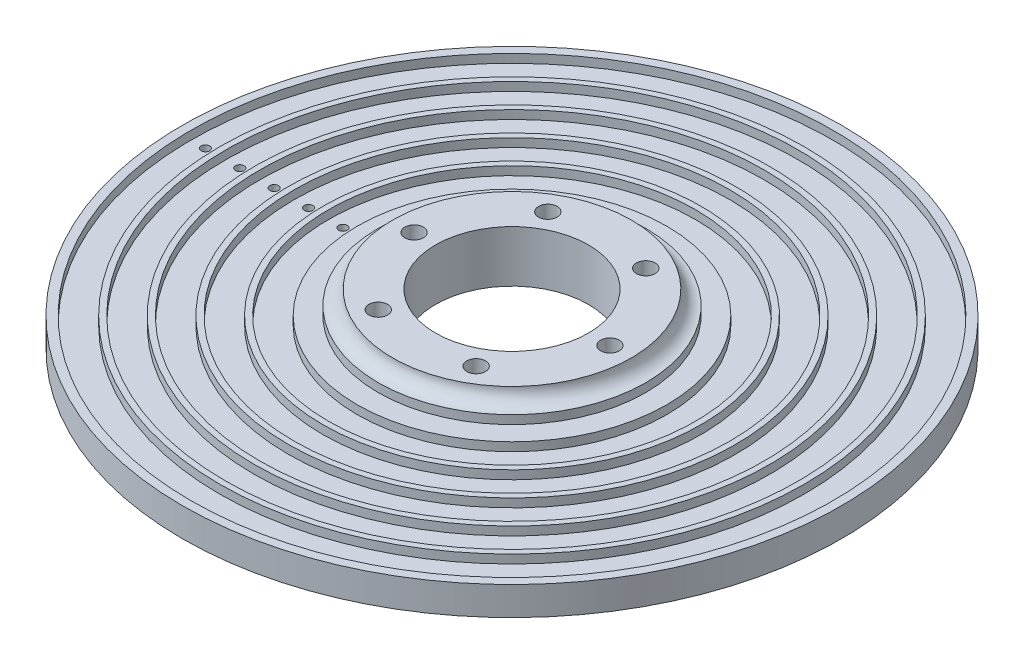
ISO-10303-21;
HEADER;
FILE_DESCRIPTION(('STEP AP214'),'2;1');
FILE_NAME('part.step','',(''),(''),'','','');
FILE_SCHEMA(('AUTOMOTIVE_DESIGN { 1 0 10303 214 1 1 1 1 }'));
ENDSEC;
DATA;
#1=APPLICATION_CONTEXT('core data for automotive mechanical design processes');
#2=APPLICATION_PROTOCOL_DEFINITION('international standard','automotive_design',2000,#1);
#3=PRODUCT_CONTEXT('',#1,'mechanical');
#4=PRODUCT('Part','Part','',(#3));
#5=PRODUCT_RELATED_PRODUCT_CATEGORY('part','',(#4));
#6=PRODUCT_DEFINITION_FORMATION('','',#4);
#7=PRODUCT_DEFINITION_CONTEXT('part definition',#1,'design');
#8=PRODUCT_DEFINITION('design','',#6,#7);
#9=PRODUCT_DEFINITION_SHAPE('','',#8);
#10=(LENGTH_UNIT() NAMED_UNIT(*) SI_UNIT(.MILLI.,.METRE.));
#11=(NAMED_UNIT(*) PLANE_ANGLE_UNIT() SI_UNIT($,.RADIAN.));
#12=(NAMED_UNIT(*) SI_UNIT($,.STERADIAN.) SOLID_ANGLE_UNIT());
#13=UNCERTAINTY_MEASURE_WITH_UNIT(LENGTH_MEASURE(1.E-05),#10,'distance_accuracy_value','');
#14=(GEOMETRIC_REPRESENTATION_CONTEXT(3) GLOBAL_UNCERTAINTY_ASSIGNED_CONTEXT((#13)) GLOBAL_UNIT_ASSIGNED_CONTEXT((#10,
#11,#12)) REPRESENTATION_CONTEXT('',''));
#15=CARTESIAN_POINT('',(0.,0.,0.));
#16=DIRECTION('',(0.,0.,1.));
#17=DIRECTION('',(1.,0.,0.));
#18=AXIS2_PLACEMENT_3D('',#15,#16,#17);
#19=CARTESIAN_POINT('',(8.54250000000001,-5.,14.7960440236571));
#20=DIRECTION('',(0.,1.,0.));
#21=DIRECTION('',(0.,0.,1.));
#22=AXIS2_PLACEMENT_3D('',#19,#20,#21);
#23=CYLINDRICAL_SURFACE('',#22,1.625);
#24=CARTESIAN_POINT('',(8.54250000000001,4.,14.7960440236571));
#25=DIRECTION('',(0.,1.,0.));
#26=DIRECTION('',(0.,0.,1.));
#27=AXIS2_PLACEMENT_3D('',#24,#25,#26);
#28=CIRCLE('',#27,1.625);
#29=CARTESIAN_POINT('',(8.54250000000001,4.,16.4210440236571));
#30=VERTEX_POINT('',#29);
#31=EDGE_CURVE('E174',#30,#30,#28,.T.);
#32=ORIENTED_EDGE('',*,*,#31,.T.);
#33=EDGE_LOOP('',(#32));
#34=FACE_BOUND('',#33,.T.);
#35=CARTESIAN_POINT('',(8.54250000000001,-2.,14.7960440236571));
#36=DIRECTION('',(0.,-1.,0.));
#37=DIRECTION('',(0.,0.,-1.));
#38=AXIS2_PLACEMENT_3D('',#35,#36,#37);
#39=CIRCLE('',#38,1.625);
#40=CARTESIAN_POINT('',(8.54250000000001,-2.,13.1710440236571));
#41=VERTEX_POINT('',#40);
#42=EDGE_CURVE('E95',#41,#41,#39,.F.);
#43=ORIENTED_EDGE('',*,*,#42,.F.);
#44=EDGE_LOOP('',(#43));
#45=FACE_BOUND('',#44,.T.);
#46=ADVANCED_FACE('F91',(#34,#45),#23,.F.);
#47=CARTESIAN_POINT('',(8.5425,-5.,-14.7960440236571));
#48=DIRECTION('',(0.,1.,0.));
#49=DIRECTION('',(0.,0.,1.));
#50=AXIS2_PLACEMENT_3D('',#47,#48,#49);
#51=CYLINDRICAL_SURFACE('',#50,1.625);
#52=CARTESIAN_POINT('',(8.5425,4.,-14.7960440236571));
#53=DIRECTION('',(0.,1.,0.));
#54=DIRECTION('',(0.,0.,1.));
#55=AXIS2_PLACEMENT_3D('',#52,#53,#54);
#56=CIRCLE('',#55,1.625);
#57=CARTESIAN_POINT('',(8.5425,4.,-13.1710440236571));
#58=VERTEX_POINT('',#57);
#59=EDGE_CURVE('E165',#58,#58,#56,.T.);
#60=ORIENTED_EDGE('',*,*,#59,.T.);
#61=EDGE_LOOP('',(#60));
#62=FACE_BOUND('',#61,.T.);
#63=CARTESIAN_POINT('',(8.5425,-2.,-14.7960440236571));
#64=DIRECTION('',(0.,-1.,0.));
#65=DIRECTION('',(0.,0.,-1.));
#66=AXIS2_PLACEMENT_3D('',#63,#64,#65);
#67=CIRCLE('',#66,1.625);
#68=CARTESIAN_POINT('',(8.5425,-2.,-16.4210440236571));
#69=VERTEX_POINT('',#68);
#70=EDGE_CURVE('E117',#69,#69,#67,.F.);
#71=ORIENTED_EDGE('',*,*,#70,.F.);
#72=EDGE_LOOP('',(#71));
#73=FACE_BOUND('',#72,.T.);
#74=ADVANCED_FACE('F291',(#62,#73),#51,.F.);
#75=CARTESIAN_POINT('',(-17.085,-5.,0.));
#76=DIRECTION('',(0.,1.,0.));
#77=DIRECTION('',(0.,0.,1.));
#78=AXIS2_PLACEMENT_3D('',#75,#76,#77);
#79=CYLINDRICAL_SURFACE('',#78,1.625);
#80=CARTESIAN_POINT('',(-17.085,4.,0.));
#81=DIRECTION('',(0.,1.,0.));
#82=DIRECTION('',(0.,0.,1.));
#83=AXIS2_PLACEMENT_3D('',#80,#81,#82);
#84=CIRCLE('',#83,1.625);
#85=CARTESIAN_POINT('',(-17.085,4.,1.62500000000001));
#86=VERTEX_POINT('',#85);
#87=EDGE_CURVE('E183',#86,#86,#84,.T.);
#88=ORIENTED_EDGE('',*,*,#87,.T.);
#89=EDGE_LOOP('',(#88));
#90=FACE_BOUND('',#89,.T.);
#91=CARTESIAN_POINT('',(-17.085,-2.,0.));
#92=DIRECTION('',(0.,-1.,0.));
#93=DIRECTION('',(0.,0.,-1.));
#94=AXIS2_PLACEMENT_3D('',#91,#92,#93);
#95=CIRCLE('',#94,1.625);
#96=CARTESIAN_POINT('',(-17.085,-2.,-1.625));
#97=VERTEX_POINT('',#96);
#98=EDGE_CURVE('E113',#97,#97,#95,.F.);
#99=ORIENTED_EDGE('',*,*,#98,.F.);
#100=EDGE_LOOP('',(#99));
#101=FACE_BOUND('',#100,.T.);
#102=ADVANCED_FACE('F298',(#90,#101),#79,.F.);
#103=CARTESIAN_POINT('',(0.,4.,0.));
#104=DIRECTION('',(0.,1.,0.));
#105=DIRECTION('',(0.,0.,1.));
#106=AXIS2_PLACEMENT_3D('',#103,#104,#105);
#107=PLANE('',#106);
#108=ORIENTED_EDGE('',*,*,#59,.F.);
#109=EDGE_LOOP('',(#108));
#110=FACE_BOUND('',#109,.T.);
#111=CARTESIAN_POINT('',(17.085,4.,0.));
#112=DIRECTION('',(0.,1.,0.));
#113=DIRECTION('',(0.,0.,1.));
#114=AXIS2_PLACEMENT_3D('',#111,#112,#113);
#115=CIRCLE('',#114,1.625);
#116=CARTESIAN_POINT('',(17.085,4.,1.62499999999999));
#117=VERTEX_POINT('',#116);
#118=EDGE_CURVE('E170',#117,#117,#115,.T.);
#119=ORIENTED_EDGE('',*,*,#118,.F.);
#120=EDGE_LOOP('',(#119));
#121=FACE_BOUND('',#120,.T.);
#122=ORIENTED_EDGE('',*,*,#31,.F.);
#123=EDGE_LOOP('',(#122));
#124=FACE_BOUND('',#123,.T.);
#125=CARTESIAN_POINT('',(-8.5425,4.,14.7960440236571));
#126=DIRECTION('',(0.,1.,0.));
#127=DIRECTION('',(0.,0.,1.));
#128=AXIS2_PLACEMENT_3D('',#125,#126,#127);
#129=CIRCLE('',#128,1.625);
#130=CARTESIAN_POINT('',(-8.5425,4.,16.4210440236571));
#131=VERTEX_POINT('',#130);
#132=EDGE_CURVE('E179',#131,#131,#129,.T.);
#133=ORIENTED_EDGE('',*,*,#132,.F.);
#134=EDGE_LOOP('',(#133));
#135=FACE_BOUND('',#134,.T.);
#136=ORIENTED_EDGE('',*,*,#87,.F.);
#137=EDGE_LOOP('',(#136));
#138=FACE_BOUND('',#137,.T.);
#139=CARTESIAN_POINT('',(-8.54250000000001,4.,-14.7960440236571));
#140=DIRECTION('',(0.,1.,0.));
#141=DIRECTION('',(0.,0.,1.));
#142=AXIS2_PLACEMENT_3D('',#139,#140,#141);
#143=CIRCLE('',#142,1.625);
#144=CARTESIAN_POINT('',(-8.54250000000001,4.,-13.1710440236571));
#145=VERTEX_POINT('',#144);
#146=EDGE_CURVE('E188',#145,#145,#143,.T.);
#147=ORIENTED_EDGE('',*,*,#146,.F.);
#148=EDGE_LOOP('',(#147));
#149=FACE_BOUND('',#148,.T.);
#150=CARTESIAN_POINT('',(0.,4.,0.));
#151=DIRECTION('',(0.,1.,0.));
#152=DIRECTION('',(0.,0.,1.));
#153=AXIS2_PLACEMENT_3D('',#150,#151,#152);
#154=CIRCLE('',#153,13.335);
#155=CARTESIAN_POINT('',(0.,4.,13.335));
#156=VERTEX_POINT('',#155);
#157=EDGE_CURVE('E11',#156,#156,#154,.T.);
#158=ORIENTED_EDGE('',*,*,#157,.F.);
#159=EDGE_LOOP('',(#158));
#160=FACE_BOUND('',#159,.T.);
#161=CARTESIAN_POINT('',(0.,4.,0.));
#162=DIRECTION('',(0.,-1.,0.));
#163=DIRECTION('',(0.,0.,-1.));
#164=AXIS2_PLACEMENT_3D('',#161,#162,#163);
#165=CIRCLE('',#164,20.835);
#166=CARTESIAN_POINT('',(0.,4.,-20.835));
#167=VERTEX_POINT('',#166);
#168=EDGE_CURVE('E111',#167,#167,#165,.T.);
#169=ORIENTED_EDGE('',*,*,#168,.F.);
#170=EDGE_LOOP('',(#169));
#171=FACE_BOUND('',#170,.T.);
#172=ADVANCED_FACE('F285',(#110,#121,#124,#135,#138,#149,#160,#171),#107,.T.);
#173=CARTESIAN_POINT('',(0.,0.,0.));
#174=DIRECTION('',(0.,-1.,0.));
#175=DIRECTION('',(0.,0.,-1.));
#176=AXIS2_PLACEMENT_3D('',#173,#174,#175);
#177=PLANE('',#176);
#178=CARTESIAN_POINT('',(0.,0.,0.));
#179=DIRECTION('',(0.,1.,0.));
#180=DIRECTION('',(0.,0.,1.));
#181=AXIS2_PLACEMENT_3D('',#178,#179,#180);
#182=CIRCLE('',#181,50.);
#183=CARTESIAN_POINT('',(0.,0.,50.));
#184=VERTEX_POINT('',#183);
#185=EDGE_CURVE('E212',#184,#184,#182,.T.);
#186=ORIENTED_EDGE('',*,*,#185,.F.);
#187=EDGE_LOOP('',(#186));
#188=FACE_BOUND('',#187,.T.);
#189=CARTESIAN_POINT('',(0.,0.,0.));
#190=DIRECTION('',(0.,1.,0.));
#191=DIRECTION('',(0.,0.,1.));
#192=AXIS2_PLACEMENT_3D('',#189,#190,#191);
#193=CIRCLE('',#192,51.);
#194=CARTESIAN_POINT('',(0.,0.,51.));
#195=VERTEX_POINT('',#194);
#196=EDGE_CURVE('E195',#195,#195,#193,.T.);
#197=ORIENTED_EDGE('',*,*,#196,.T.);
#198=EDGE_LOOP('',(#197));
#199=FACE_BOUND('',#198,.T.);
#200=ADVANCED_FACE('F271',(#188,#199),#177,.F.);
#201=CARTESIAN_POINT('',(0.,0.,0.));
#202=DIRECTION('',(0.,1.,0.));
#203=DIRECTION('',(0.,0.,1.));
#204=AXIS2_PLACEMENT_3D('',#201,#202,#203);
#205=CIRCLE('',#204,44.);
#206=CARTESIAN_POINT('',(0.,0.,44.));
#207=VERTEX_POINT('',#206);
#208=EDGE_CURVE('E224',#207,#207,#205,.T.);
#209=ORIENTED_EDGE('',*,*,#208,.F.);
#210=EDGE_LOOP('',(#209));
#211=FACE_BOUND('',#210,.T.);
#212=CARTESIAN_POINT('',(0.,0.,0.));
#213=DIRECTION('',(0.,1.,0.));
#214=DIRECTION('',(0.,0.,1.));
#215=AXIS2_PLACEMENT_3D('',#212,#213,#214);
#216=CIRCLE('',#215,45.);
#217=CARTESIAN_POINT('',(0.,0.,45.));
#218=VERTEX_POINT('',#217);
#219=EDGE_CURVE('E203',#218,#218,#216,.T.);
#220=ORIENTED_EDGE('',*,*,#219,.T.);
#221=EDGE_LOOP('',(#220));
#222=FACE_BOUND('',#221,.T.);
#223=ADVANCED_FACE('F284',(#211,#222),#177,.F.);
#224=CARTESIAN_POINT('',(0.,0.,0.));
#225=DIRECTION('',(0.,1.,0.));
#226=DIRECTION('',(0.,0.,1.));
#227=AXIS2_PLACEMENT_3D('',#224,#225,#226);
#228=CIRCLE('',#227,38.);
#229=CARTESIAN_POINT('',(0.,0.,38.));
#230=VERTEX_POINT('',#229);
#231=EDGE_CURVE('E236',#230,#230,#228,.T.);
#232=ORIENTED_EDGE('',*,*,#231,.F.);
#233=EDGE_LOOP('',(#232));
#234=FACE_BOUND('',#233,.T.);
#235=CARTESIAN_POINT('',(0.,0.,0.));
#236=DIRECTION('',(0.,1.,0.));
#237=DIRECTION('',(0.,0.,1.));
#238=AXIS2_PLACEMENT_3D('',#235,#236,#237);
#239=CIRCLE('',#238,39.);
#240=CARTESIAN_POINT('',(0.,0.,39.));
#241=VERTEX_POINT('',#240);
#242=EDGE_CURVE('E215',#241,#241,#239,.T.);
#243=ORIENTED_EDGE('',*,*,#242,.T.);
#244=EDGE_LOOP('',(#243));
#245=FACE_BOUND('',#244,.T.);
#246=ADVANCED_FACE('F395',(#234,#245),#177,.F.);
#247=CARTESIAN_POINT('',(0.,0.,0.));
#248=DIRECTION('',(0.,1.,0.));
#249=DIRECTION('',(0.,0.,1.));
#250=AXIS2_PLACEMENT_3D('',#247,#248,#249);
#251=CIRCLE('',#250,32.);
#252=CARTESIAN_POINT('',(0.,0.,32.));
#253=VERTEX_POINT('',#252);
#254=EDGE_CURVE('E248',#253,#253,#251,.T.);
#255=ORIENTED_EDGE('',*,*,#254,.F.);
#256=EDGE_LOOP('',(#255));
#257=FACE_BOUND('',#256,.T.);
#258=CARTESIAN_POINT('',(0.,0.,0.));
#259=DIRECTION('',(0.,1.,0.));
#260=DIRECTION('',(0.,0.,1.));
#261=AXIS2_PLACEMENT_3D('',#258,#259,#260);
#262=CIRCLE('',#261,33.);
#263=CARTESIAN_POINT('',(0.,0.,33.));
#264=VERTEX_POINT('',#263);
#265=EDGE_CURVE('E227',#264,#264,#262,.T.);
#266=ORIENTED_EDGE('',*,*,#265,.T.);
#267=EDGE_LOOP('',(#266));
#268=FACE_BOUND('',#267,.T.);
#269=ADVANCED_FACE('F288',(#257,#268),#177,.F.);
#270=CARTESIAN_POINT('',(0.,0.,0.));
#271=DIRECTION('',(0.,-1.,0.));
#272=DIRECTION('',(0.,0.,-1.));
#273=AXIS2_PLACEMENT_3D('',#270,#271,#272);
#274=CIRCLE('',#273,23.335);
#275=CARTESIAN_POINT('',(0.,0.,-23.335));
#276=VERTEX_POINT('',#275);
#277=EDGE_CURVE('E99',#276,#276,#274,.T.);
#278=ORIENTED_EDGE('',*,*,#277,.T.);
#279=EDGE_LOOP('',(#278));
#280=FACE_BOUND('',#279,.T.);
#281=CARTESIAN_POINT('',(0.,0.,0.));
#282=DIRECTION('',(0.,1.,0.));
#283=DIRECTION('',(0.,0.,1.));
#284=AXIS2_PLACEMENT_3D('',#281,#282,#283);
#285=CIRCLE('',#284,27.);
#286=CARTESIAN_POINT('',(0.,0.,27.));
#287=VERTEX_POINT('',#286);
#288=EDGE_CURVE('E239',#287,#287,#285,.T.);
#289=ORIENTED_EDGE('',*,*,#288,.T.);
#290=EDGE_LOOP('',(#289));
#291=FACE_BOUND('',#290,.T.);
#292=ADVANCED_FACE('F272',(#280,#291),#177,.F.);
#293=CARTESIAN_POINT('',(0.,4.,0.));
#294=DIRECTION('',(0.,-1.,0.));
#295=DIRECTION('',(0.,0.,-1.));
#296=AXIS2_PLACEMENT_3D('',#293,#294,#295);
#297=CYLINDRICAL_SURFACE('',#296,23.335);
#298=CARTESIAN_POINT('',(0.,1.5,0.));
#299=DIRECTION('',(0.,1.,0.));
#300=DIRECTION('',(0.,0.,1.));
#301=AXIS2_PLACEMENT_3D('',#298,#299,#300);
#302=CIRCLE('',#301,23.335);
#303=CARTESIAN_POINT('',(0.,1.5,23.335));
#304=VERTEX_POINT('',#303);
#305=EDGE_CURVE('E108',#304,#304,#302,.F.);
#306=ORIENTED_EDGE('',*,*,#305,.T.);
#307=EDGE_LOOP('',(#306));
#308=FACE_BOUND('',#307,.T.);
#309=ORIENTED_EDGE('',*,*,#277,.F.);
#310=EDGE_LOOP('',(#309));
#311=FACE_BOUND('',#310,.T.);
#312=ADVANCED_FACE('F93',(#308,#311),#297,.T.);
#313=CARTESIAN_POINT('',(0.,4.,0.));
#314=DIRECTION('',(0.,-1.,0.));
#315=DIRECTION('',(0.,0.,-1.));
#316=AXIS2_PLACEMENT_3D('',#313,#314,#315);
#317=CYLINDRICAL_SURFACE('',#316,13.335);
#318=ORIENTED_EDGE('',*,*,#157,.T.);
#319=EDGE_LOOP('',(#318));
#320=FACE_BOUND('',#319,.T.);
#321=CARTESIAN_POINT('',(0.,-5.,0.));
#322=DIRECTION('',(0.,-1.,0.));
#323=DIRECTION('',(0.,0.,-1.));
#324=AXIS2_PLACEMENT_3D('',#321,#322,#323);
#325=CIRCLE('',#324,13.335);
#326=CARTESIAN_POINT('',(0.,-5.,-13.335));
#327=VERTEX_POINT('',#326);
#328=EDGE_CURVE('E251',#327,#327,#325,.T.);
#329=ORIENTED_EDGE('',*,*,#328,.T.);
#330=EDGE_LOOP('',(#329));
#331=FACE_BOUND('',#330,.T.);
#332=ADVANCED_FACE('F268',(#320,#331),#317,.F.);
#333=CARTESIAN_POINT('',(0.,0.,0.));
#334=DIRECTION('',(0.,1.,0.));
#335=DIRECTION('',(0.,0.,1.));
#336=AXIS2_PLACEMENT_3D('',#333,#334,#335);
#337=CIRCLE('',#336,56.);
#338=CARTESIAN_POINT('',(0.,0.,56.));
#339=VERTEX_POINT('',#338);
#340=EDGE_CURVE('E200',#339,#339,#337,.T.);
#341=ORIENTED_EDGE('',*,*,#340,.F.);
#342=EDGE_LOOP('',(#341));
#343=FACE_BOUND('',#342,.T.);
#344=CARTESIAN_POINT('',(0.,0.,0.));
#345=DIRECTION('',(0.,-1.,0.));
#346=DIRECTION('',(0.,0.,-1.));
#347=AXIS2_PLACEMENT_3D('',#344,#345,#346);
#348=CIRCLE('',#347,57.5);
#349=CARTESIAN_POINT('',(0.,0.,-57.5));
#350=VERTEX_POINT('',#349);
#351=EDGE_CURVE('E258',#350,#350,#348,.T.);
#352=ORIENTED_EDGE('',*,*,#351,.F.);
#353=EDGE_LOOP('',(#352));
#354=FACE_BOUND('',#353,.T.);
#355=ADVANCED_FACE('F265',(#343,#354),#177,.F.);
#356=CARTESIAN_POINT('',(0.,-5.,0.));
#357=DIRECTION('',(0.,-1.,0.));
#358=DIRECTION('',(0.,0.,-1.));
#359=AXIS2_PLACEMENT_3D('',#356,#357,#358);
#360=PLANE('',#359);
#361=CARTESIAN_POINT('',(8.54250000000001,-5.,14.7960440236571));
#362=DIRECTION('',(0.,-1.,0.));
#363=DIRECTION('',(0.,0.,-1.));
#364=AXIS2_PLACEMENT_3D('',#361,#362,#363);
#365=CIRCLE('',#364,3.);
#366=CARTESIAN_POINT('',(8.54250000000001,-5.,11.7960440236571));
#367=VERTEX_POINT('',#366);
#368=EDGE_CURVE('E133',#367,#367,#365,.T.);
#369=ORIENTED_EDGE('',*,*,#368,.F.);
#370=EDGE_LOOP('',(#369));
#371=FACE_BOUND('',#370,.T.);
#372=CARTESIAN_POINT('',(8.5425,-5.,-14.7960440236571));
#373=DIRECTION('',(0.,-1.,0.));
#374=DIRECTION('',(0.,0.,-1.));
#375=AXIS2_PLACEMENT_3D('',#372,#373,#374);
#376=CIRCLE('',#375,3.);
#377=CARTESIAN_POINT('',(8.5425,-5.,-17.7960440236571));
#378=VERTEX_POINT('',#377);
#379=EDGE_CURVE('E126',#378,#378,#376,.T.);
#380=ORIENTED_EDGE('',*,*,#379,.F.);
#381=EDGE_LOOP('',(#380));
#382=FACE_BOUND('',#381,.T.);
#383=CARTESIAN_POINT('',(-17.085,-5.,0.));
#384=DIRECTION('',(0.,-1.,0.));
#385=DIRECTION('',(0.,0.,-1.));
#386=AXIS2_PLACEMENT_3D('',#383,#384,#385);
#387=CIRCLE('',#386,3.);
#388=CARTESIAN_POINT('',(-17.085,-5.,-2.99999999999999));
#389=VERTEX_POINT('',#388);
#390=EDGE_CURVE('E119',#389,#389,#387,.T.);
#391=ORIENTED_EDGE('',*,*,#390,.F.);
#392=EDGE_LOOP('',(#391));
#393=FACE_BOUND('',#392,.T.);
#394=CARTESIAN_POINT('',(-29.5,-5.,0.));
#395=DIRECTION('',(0.,1.,0.));
#396=DIRECTION('',(0.,0.,1.));
#397=AXIS2_PLACEMENT_3D('',#394,#395,#396);
#398=CIRCLE('',#397,0.750000000000002);
#399=CARTESIAN_POINT('',(-29.5,-5.,0.750000000000002));
#400=VERTEX_POINT('',#399);
#401=EDGE_CURVE('E138',#400,#400,#398,.T.);
#402=ORIENTED_EDGE('',*,*,#401,.T.);
#403=EDGE_LOOP('',(#402));
#404=FACE_BOUND('',#403,.T.);
#405=CARTESIAN_POINT('',(-35.5,-5.,0.));
#406=DIRECTION('',(0.,1.,0.));
#407=DIRECTION('',(0.,0.,1.));
#408=AXIS2_PLACEMENT_3D('',#405,#406,#407);
#409=CIRCLE('',#408,0.749999999999999);
#410=CARTESIAN_POINT('',(-35.5,-5.,0.749999999999999));
#411=VERTEX_POINT('',#410);
#412=EDGE_CURVE('E144',#411,#411,#409,.T.);
#413=ORIENTED_EDGE('',*,*,#412,.T.);
#414=EDGE_LOOP('',(#413));
#415=FACE_BOUND('',#414,.T.);
#416=CARTESIAN_POINT('',(-41.5,-5.,0.));
#417=DIRECTION('',(0.,1.,0.));
#418=DIRECTION('',(0.,0.,1.));
#419=AXIS2_PLACEMENT_3D('',#416,#417,#418);
#420=CIRCLE('',#419,0.749999999999999);
#421=CARTESIAN_POINT('',(-41.5,-5.,0.749999999999999));
#422=VERTEX_POINT('',#421);
#423=EDGE_CURVE('E150',#422,#422,#420,.T.);
#424=ORIENTED_EDGE('',*,*,#423,.T.);
#425=EDGE_LOOP('',(#424));
#426=FACE_BOUND('',#425,.T.);
#427=CARTESIAN_POINT('',(-47.5,-5.,0.));
#428=DIRECTION('',(0.,1.,0.));
#429=DIRECTION('',(0.,0.,1.));
#430=AXIS2_PLACEMENT_3D('',#427,#428,#429);
#431=CIRCLE('',#430,0.749999999999999);
#432=CARTESIAN_POINT('',(-47.5,-5.,0.749999999999999));
#433=VERTEX_POINT('',#432);
#434=EDGE_CURVE('E156',#433,#433,#431,.T.);
#435=ORIENTED_EDGE('',*,*,#434,.T.);
#436=EDGE_LOOP('',(#435));
#437=FACE_BOUND('',#436,.T.);
#438=CARTESIAN_POINT('',(-53.5,-5.,0.));
#439=DIRECTION('',(0.,1.,0.));
#440=DIRECTION('',(0.,0.,1.));
#441=AXIS2_PLACEMENT_3D('',#438,#439,#440);
#442=CIRCLE('',#441,0.749999999999999);
#443=CARTESIAN_POINT('',(-53.5,-5.,0.749999999999999));
#444=VERTEX_POINT('',#443);
#445=EDGE_CURVE('E162',#444,#444,#442,.T.);
#446=ORIENTED_EDGE('',*,*,#445,.T.);
#447=EDGE_LOOP('',(#446));
#448=FACE_BOUND('',#447,.T.);
#449=CARTESIAN_POINT('',(17.085,-5.,0.));
#450=DIRECTION('',(0.,1.,0.));
#451=DIRECTION('',(0.,0.,1.));
#452=AXIS2_PLACEMENT_3D('',#449,#450,#451);
#453=CIRCLE('',#452,1.625);
#454=CARTESIAN_POINT('',(17.085,-5.,1.62499999999999));
#455=VERTEX_POINT('',#454);
#456=EDGE_CURVE('E171',#455,#455,#453,.T.);
#457=ORIENTED_EDGE('',*,*,#456,.T.);
#458=EDGE_LOOP('',(#457));
#459=FACE_BOUND('',#458,.T.);
#460=CARTESIAN_POINT('',(-8.5425,-5.,14.7960440236571));
#461=DIRECTION('',(0.,1.,0.));
#462=DIRECTION('',(0.,0.,1.));
#463=AXIS2_PLACEMENT_3D('',#460,#461,#462);
#464=CIRCLE('',#463,1.625);
#465=CARTESIAN_POINT('',(-8.5425,-5.,16.4210440236571));
#466=VERTEX_POINT('',#465);
#467=EDGE_CURVE('E180',#466,#466,#464,.T.);
#468=ORIENTED_EDGE('',*,*,#467,.T.);
#469=EDGE_LOOP('',(#468));
#470=FACE_BOUND('',#469,.T.);
#471=CARTESIAN_POINT('',(-8.54250000000001,-5.,-14.7960440236571));
#472=DIRECTION('',(0.,1.,0.));
#473=DIRECTION('',(0.,0.,1.));
#474=AXIS2_PLACEMENT_3D('',#471,#472,#473);
#475=CIRCLE('',#474,1.625);
#476=CARTESIAN_POINT('',(-8.54250000000001,-5.,-13.1710440236571));
#477=VERTEX_POINT('',#476);
#478=EDGE_CURVE('E112',#477,#477,#475,.T.);
#479=ORIENTED_EDGE('',*,*,#478,.T.);
#480=EDGE_LOOP('',(#479));
#481=FACE_BOUND('',#480,.T.);
#482=CARTESIAN_POINT('',(0.,-5.,0.));
#483=DIRECTION('',(0.,-1.,0.));
#484=DIRECTION('',(0.,0.,-1.));
#485=AXIS2_PLACEMENT_3D('',#482,#483,#484);
#486=CIRCLE('',#485,57.5);
#487=CARTESIAN_POINT('',(0.,-5.,-57.5));
#488=VERTEX_POINT('',#487);
#489=EDGE_CURVE('E104',#488,#488,#486,.T.);
#490=ORIENTED_EDGE('',*,*,#489,.T.);
#491=EDGE_LOOP('',(#490));
#492=FACE_BOUND('',#491,.T.);
#493=ORIENTED_EDGE('',*,*,#328,.F.);
#494=EDGE_LOOP('',(#493));
#495=FACE_BOUND('',#494,.T.);
#496=ADVANCED_FACE('F267',(#371,#382,#393,#404,#415,#426,#437,#448,#459,#470,#481,#492,#495),
#360,.T.);
#497=CARTESIAN_POINT('',(0.,-5.,0.));
#498=DIRECTION('',(0.,1.,0.));
#499=DIRECTION('',(0.,0.,1.));
#500=AXIS2_PLACEMENT_3D('',#497,#498,#499);
#501=CYLINDRICAL_SURFACE('',#500,57.5);
#502=ORIENTED_EDGE('',*,*,#489,.F.);
#503=EDGE_LOOP('',(#502));
#504=FACE_BOUND('',#503,.T.);
#505=ORIENTED_EDGE('',*,*,#351,.T.);
#506=EDGE_LOOP('',(#505));
#507=FACE_BOUND('',#506,.T.);
#508=ADVANCED_FACE('F263',(#504,#507),#501,.T.);
#509=CARTESIAN_POINT('',(0.,-1.5,0.));
#510=DIRECTION('',(0.,1.,0.));
#511=DIRECTION('',(0.,0.,1.));
#512=AXIS2_PLACEMENT_3D('',#509,#510,#511);
#513=CYLINDRICAL_SURFACE('',#512,27.);
#514=CARTESIAN_POINT('',(0.,-1.5,0.));
#515=DIRECTION('',(0.,1.,0.));
#516=DIRECTION('',(0.,0.,1.));
#517=AXIS2_PLACEMENT_3D('',#514,#515,#516);
#518=CIRCLE('',#517,27.);
#519=CARTESIAN_POINT('',(0.,-1.5,27.));
#520=VERTEX_POINT('',#519);
#521=EDGE_CURVE('E244',#520,#520,#518,.T.);
#522=ORIENTED_EDGE('',*,*,#521,.T.);
#523=EDGE_LOOP('',(#522));
#524=FACE_BOUND('',#523,.T.);
#525=ORIENTED_EDGE('',*,*,#288,.F.);
#526=EDGE_LOOP('',(#525));
#527=FACE_BOUND('',#526,.T.);
#528=ADVANCED_FACE('F375',(#524,#527),#513,.T.);
#529=CARTESIAN_POINT('',(0.,-1.5,0.));
#530=DIRECTION('',(0.,1.,0.));
#531=DIRECTION('',(0.,0.,1.));
#532=AXIS2_PLACEMENT_3D('',#529,#530,#531);
#533=CYLINDRICAL_SURFACE('',#532,32.);
#534=CARTESIAN_POINT('',(0.,-1.5,0.));
#535=DIRECTION('',(0.,1.,0.));
#536=DIRECTION('',(0.,0.,1.));
#537=AXIS2_PLACEMENT_3D('',#534,#535,#536);
#538=CIRCLE('',#537,32.);
#539=CARTESIAN_POINT('',(0.,-1.5,32.));
#540=VERTEX_POINT('',#539);
#541=EDGE_CURVE('E247',#540,#540,#538,.T.);
#542=ORIENTED_EDGE('',*,*,#541,.F.);
#543=EDGE_LOOP('',(#542));
#544=FACE_BOUND('',#543,.T.);
#545=ORIENTED_EDGE('',*,*,#254,.T.);
#546=EDGE_LOOP('',(#545));
#547=FACE_BOUND('',#546,.T.);
#548=ADVANCED_FACE('F371',(#544,#547),#533,.F.);
#549=CARTESIAN_POINT('',(0.,-1.5,0.));
#550=DIRECTION('',(0.,1.,0.));
#551=DIRECTION('',(0.,0.,1.));
#552=AXIS2_PLACEMENT_3D('',#549,#550,#551);
#553=PLANE('',#552);
#554=CARTESIAN_POINT('',(-29.5,-1.5,0.));
#555=DIRECTION('',(0.,1.,0.));
#556=DIRECTION('',(0.,0.,1.));
#557=AXIS2_PLACEMENT_3D('',#554,#555,#556);
#558=CIRCLE('',#557,0.750000000000002);
#559=CARTESIAN_POINT('',(-29.5,-1.5,0.750000000000002));
#560=VERTEX_POINT('',#559);
#561=EDGE_CURVE('E115',#560,#560,#558,.T.);
#562=ORIENTED_EDGE('',*,*,#561,.F.);
#563=EDGE_LOOP('',(#562));
#564=FACE_BOUND('',#563,.T.);
#565=ORIENTED_EDGE('',*,*,#521,.F.);
#566=EDGE_LOOP('',(#565));
#567=FACE_BOUND('',#566,.T.);
#568=ORIENTED_EDGE('',*,*,#541,.T.);
#569=EDGE_LOOP('',(#568));
#570=FACE_BOUND('',#569,.T.);
#571=ADVANCED_FACE('F367',(#564,#567,#570),#553,.T.);
#572=CARTESIAN_POINT('',(0.,-1.5,0.));
#573=DIRECTION('',(0.,1.,0.));
#574=DIRECTION('',(0.,0.,1.));
#575=AXIS2_PLACEMENT_3D('',#572,#573,#574);
#576=CYLINDRICAL_SURFACE('',#575,33.);
#577=CARTESIAN_POINT('',(0.,-1.5,0.));
#578=DIRECTION('',(0.,1.,0.));
#579=DIRECTION('',(0.,0.,1.));
#580=AXIS2_PLACEMENT_3D('',#577,#578,#579);
#581=CIRCLE('',#580,33.);
#582=CARTESIAN_POINT('',(0.,-1.5,33.));
#583=VERTEX_POINT('',#582);
#584=EDGE_CURVE('E232',#583,#583,#581,.T.);
#585=ORIENTED_EDGE('',*,*,#584,.T.);
#586=EDGE_LOOP('',(#585));
#587=FACE_BOUND('',#586,.T.);
#588=ORIENTED_EDGE('',*,*,#265,.F.);
#589=EDGE_LOOP('',(#588));
#590=FACE_BOUND('',#589,.T.);
#591=ADVANCED_FACE('F363',(#587,#590),#576,.T.);
#592=CARTESIAN_POINT('',(0.,-1.5,0.));
#593=DIRECTION('',(0.,1.,0.));
#594=DIRECTION('',(0.,0.,1.));
#595=AXIS2_PLACEMENT_3D('',#592,#593,#594);
#596=CYLINDRICAL_SURFACE('',#595,38.);
#597=CARTESIAN_POINT('',(0.,-1.5,0.));
#598=DIRECTION('',(0.,1.,0.));
#599=DIRECTION('',(0.,0.,1.));
#600=AXIS2_PLACEMENT_3D('',#597,#598,#599);
#601=CIRCLE('',#600,38.);
#602=CARTESIAN_POINT('',(0.,-1.5,38.));
#603=VERTEX_POINT('',#602);
#604=EDGE_CURVE('E235',#603,#603,#601,.T.);
#605=ORIENTED_EDGE('',*,*,#604,.F.);
#606=EDGE_LOOP('',(#605));
#607=FACE_BOUND('',#606,.T.);
#608=ORIENTED_EDGE('',*,*,#231,.T.);
#609=EDGE_LOOP('',(#608));
#610=FACE_BOUND('',#609,.T.);
#611=ADVANCED_FACE('F359',(#607,#610),#596,.F.);
#612=CARTESIAN_POINT('',(0.,-1.5,0.));
#613=DIRECTION('',(0.,1.,0.));
#614=DIRECTION('',(0.,0.,1.));
#615=AXIS2_PLACEMENT_3D('',#612,#613,#614);
#616=PLANE('',#615);
#617=CARTESIAN_POINT('',(-35.5,-1.5,0.));
#618=DIRECTION('',(0.,1.,0.));
#619=DIRECTION('',(0.,0.,1.));
#620=AXIS2_PLACEMENT_3D('',#617,#618,#619);
#621=CIRCLE('',#620,0.749999999999999);
#622=CARTESIAN_POINT('',(-35.5,-1.5,0.749999999999999));
#623=VERTEX_POINT('',#622);
#624=EDGE_CURVE('E141',#623,#623,#621,.T.);
#625=ORIENTED_EDGE('',*,*,#624,.F.);
#626=EDGE_LOOP('',(#625));
#627=FACE_BOUND('',#626,.T.);
#628=ORIENTED_EDGE('',*,*,#584,.F.);
#629=EDGE_LOOP('',(#628));
#630=FACE_BOUND('',#629,.T.);
#631=ORIENTED_EDGE('',*,*,#604,.T.);
#632=EDGE_LOOP('',(#631));
#633=FACE_BOUND('',#632,.T.);
#634=ADVANCED_FACE('F355',(#627,#630,#633),#616,.T.);
#635=CARTESIAN_POINT('',(0.,-1.5,0.));
#636=DIRECTION('',(0.,1.,0.));
#637=DIRECTION('',(0.,0.,1.));
#638=AXIS2_PLACEMENT_3D('',#635,#636,#637);
#639=CYLINDRICAL_SURFACE('',#638,39.);
#640=CARTESIAN_POINT('',(0.,-1.5,0.));
#641=DIRECTION('',(0.,1.,0.));
#642=DIRECTION('',(0.,0.,1.));
#643=AXIS2_PLACEMENT_3D('',#640,#641,#642);
#644=CIRCLE('',#643,39.);
#645=CARTESIAN_POINT('',(0.,-1.5,39.));
#646=VERTEX_POINT('',#645);
#647=EDGE_CURVE('E220',#646,#646,#644,.T.);
#648=ORIENTED_EDGE('',*,*,#647,.T.);
#649=EDGE_LOOP('',(#648));
#650=FACE_BOUND('',#649,.T.);
#651=ORIENTED_EDGE('',*,*,#242,.F.);
#652=EDGE_LOOP('',(#651));
#653=FACE_BOUND('',#652,.T.);
#654=ADVANCED_FACE('F351',(#650,#653),#639,.T.);
#655=CARTESIAN_POINT('',(0.,-1.5,0.));
#656=DIRECTION('',(0.,1.,0.));
#657=DIRECTION('',(0.,0.,1.));
#658=AXIS2_PLACEMENT_3D('',#655,#656,#657);
#659=CYLINDRICAL_SURFACE('',#658,44.);
#660=CARTESIAN_POINT('',(0.,-1.5,0.));
#661=DIRECTION('',(0.,1.,0.));
#662=DIRECTION('',(0.,0.,1.));
#663=AXIS2_PLACEMENT_3D('',#660,#661,#662);
#664=CIRCLE('',#663,44.);
#665=CARTESIAN_POINT('',(0.,-1.5,44.));
#666=VERTEX_POINT('',#665);
#667=EDGE_CURVE('E223',#666,#666,#664,.T.);
#668=ORIENTED_EDGE('',*,*,#667,.F.);
#669=EDGE_LOOP('',(#668));
#670=FACE_BOUND('',#669,.T.);
#671=ORIENTED_EDGE('',*,*,#208,.T.);
#672=EDGE_LOOP('',(#671));
#673=FACE_BOUND('',#672,.T.);
#674=ADVANCED_FACE('F347',(#670,#673),#659,.F.);
#675=CARTESIAN_POINT('',(0.,-1.5,0.));
#676=DIRECTION('',(0.,1.,0.));
#677=DIRECTION('',(0.,0.,1.));
#678=AXIS2_PLACEMENT_3D('',#675,#676,#677);
#679=PLANE('',#678);
#680=CARTESIAN_POINT('',(-41.5,-1.5,0.));
#681=DIRECTION('',(0.,1.,0.));
#682=DIRECTION('',(0.,0.,1.));
#683=AXIS2_PLACEMENT_3D('',#680,#681,#682);
#684=CIRCLE('',#683,0.749999999999999);
#685=CARTESIAN_POINT('',(-41.5,-1.5,0.749999999999999));
#686=VERTEX_POINT('',#685);
#687=EDGE_CURVE('E147',#686,#686,#684,.T.);
#688=ORIENTED_EDGE('',*,*,#687,.F.);
#689=EDGE_LOOP('',(#688));
#690=FACE_BOUND('',#689,.T.);
#691=ORIENTED_EDGE('',*,*,#647,.F.);
#692=EDGE_LOOP('',(#691));
#693=FACE_BOUND('',#692,.T.);
#694=ORIENTED_EDGE('',*,*,#667,.T.);
#695=EDGE_LOOP('',(#694));
#696=FACE_BOUND('',#695,.T.);
#697=ADVANCED_FACE('F343',(#690,#693,#696),#679,.T.);
#698=CARTESIAN_POINT('',(0.,-1.5,0.));
#699=DIRECTION('',(0.,1.,0.));
#700=DIRECTION('',(0.,0.,1.));
#701=AXIS2_PLACEMENT_3D('',#698,#699,#700);
#702=CYLINDRICAL_SURFACE('',#701,45.);
#703=CARTESIAN_POINT('',(0.,-1.5,0.));
#704=DIRECTION('',(0.,1.,0.));
#705=DIRECTION('',(0.,0.,1.));
#706=AXIS2_PLACEMENT_3D('',#703,#704,#705);
#707=CIRCLE('',#706,45.);
#708=CARTESIAN_POINT('',(0.,-1.5,45.));
#709=VERTEX_POINT('',#708);
#710=EDGE_CURVE('E208',#709,#709,#707,.T.);
#711=ORIENTED_EDGE('',*,*,#710,.T.);
#712=EDGE_LOOP('',(#711));
#713=FACE_BOUND('',#712,.T.);
#714=ORIENTED_EDGE('',*,*,#219,.F.);
#715=EDGE_LOOP('',(#714));
#716=FACE_BOUND('',#715,.T.);
#717=ADVANCED_FACE('F339',(#713,#716),#702,.T.);
#718=CARTESIAN_POINT('',(0.,-1.5,0.));
#719=DIRECTION('',(0.,1.,0.));
#720=DIRECTION('',(0.,0.,1.));
#721=AXIS2_PLACEMENT_3D('',#718,#719,#720);
#722=CYLINDRICAL_SURFACE('',#721,50.);
#723=CARTESIAN_POINT('',(0.,-1.5,0.));
#724=DIRECTION('',(0.,1.,0.));
#725=DIRECTION('',(0.,0.,1.));
#726=AXIS2_PLACEMENT_3D('',#723,#724,#725);
#727=CIRCLE('',#726,50.);
#728=CARTESIAN_POINT('',(0.,-1.5,50.));
#729=VERTEX_POINT('',#728);
#730=EDGE_CURVE('E211',#729,#729,#727,.T.);
#731=ORIENTED_EDGE('',*,*,#730,.F.);
#732=EDGE_LOOP('',(#731));
#733=FACE_BOUND('',#732,.T.);
#734=ORIENTED_EDGE('',*,*,#185,.T.);
#735=EDGE_LOOP('',(#734));
#736=FACE_BOUND('',#735,.T.);
#737=ADVANCED_FACE('F335',(#733,#736),#722,.F.);
#738=CARTESIAN_POINT('',(0.,-1.5,0.));
#739=DIRECTION('',(0.,1.,0.));
#740=DIRECTION('',(0.,0.,1.));
#741=AXIS2_PLACEMENT_3D('',#738,#739,#740);
#742=PLANE('',#741);
#743=CARTESIAN_POINT('',(-47.5,-1.5,0.));
#744=DIRECTION('',(0.,1.,0.));
#745=DIRECTION('',(0.,0.,1.));
#746=AXIS2_PLACEMENT_3D('',#743,#744,#745);
#747=CIRCLE('',#746,0.749999999999999);
#748=CARTESIAN_POINT('',(-47.5,-1.5,0.749999999999999));
#749=VERTEX_POINT('',#748);
#750=EDGE_CURVE('E153',#749,#749,#747,.T.);
#751=ORIENTED_EDGE('',*,*,#750,.F.);
#752=EDGE_LOOP('',(#751));
#753=FACE_BOUND('',#752,.T.);
#754=ORIENTED_EDGE('',*,*,#710,.F.);
#755=EDGE_LOOP('',(#754));
#756=FACE_BOUND('',#755,.T.);
#757=ORIENTED_EDGE('',*,*,#730,.T.);
#758=EDGE_LOOP('',(#757));
#759=FACE_BOUND('',#758,.T.);
#760=ADVANCED_FACE('F331',(#753,#756,#759),#742,.T.);
#761=CARTESIAN_POINT('',(0.,-1.5,0.));
#762=DIRECTION('',(0.,1.,0.));
#763=DIRECTION('',(0.,0.,1.));
#764=AXIS2_PLACEMENT_3D('',#761,#762,#763);
#765=CYLINDRICAL_SURFACE('',#764,51.);
#766=CARTESIAN_POINT('',(0.,-1.5,0.));
#767=DIRECTION('',(0.,1.,0.));
#768=DIRECTION('',(0.,0.,1.));
#769=AXIS2_PLACEMENT_3D('',#766,#767,#768);
#770=CIRCLE('',#769,51.);
#771=CARTESIAN_POINT('',(0.,-1.5,51.));
#772=VERTEX_POINT('',#771);
#773=EDGE_CURVE('E196',#772,#772,#770,.T.);
#774=ORIENTED_EDGE('',*,*,#773,.T.);
#775=EDGE_LOOP('',(#774));
#776=FACE_BOUND('',#775,.T.);
#777=ORIENTED_EDGE('',*,*,#196,.F.);
#778=EDGE_LOOP('',(#777));
#779=FACE_BOUND('',#778,.T.);
#780=ADVANCED_FACE('F327',(#776,#779),#765,.T.);
#781=CARTESIAN_POINT('',(0.,-1.5,0.));
#782=DIRECTION('',(0.,1.,0.));
#783=DIRECTION('',(0.,0.,1.));
#784=AXIS2_PLACEMENT_3D('',#781,#782,#783);
#785=CYLINDRICAL_SURFACE('',#784,56.);
#786=CARTESIAN_POINT('',(0.,-1.5,0.));
#787=DIRECTION('',(0.,1.,0.));
#788=DIRECTION('',(0.,0.,1.));
#789=AXIS2_PLACEMENT_3D('',#786,#787,#788);
#790=CIRCLE('',#789,56.);
#791=CARTESIAN_POINT('',(0.,-1.5,56.));
#792=VERTEX_POINT('',#791);
#793=EDGE_CURVE('E199',#792,#792,#790,.T.);
#794=ORIENTED_EDGE('',*,*,#793,.F.);
#795=EDGE_LOOP('',(#794));
#796=FACE_BOUND('',#795,.T.);
#797=ORIENTED_EDGE('',*,*,#340,.T.);
#798=EDGE_LOOP('',(#797));
#799=FACE_BOUND('',#798,.T.);
#800=ADVANCED_FACE('F323',(#796,#799),#785,.F.);
#801=CARTESIAN_POINT('',(0.,-1.5,0.));
#802=DIRECTION('',(0.,1.,0.));
#803=DIRECTION('',(0.,0.,1.));
#804=AXIS2_PLACEMENT_3D('',#801,#802,#803);
#805=PLANE('',#804);
#806=CARTESIAN_POINT('',(-53.5,-1.5,0.));
#807=DIRECTION('',(0.,1.,0.));
#808=DIRECTION('',(0.,0.,1.));
#809=AXIS2_PLACEMENT_3D('',#806,#807,#808);
#810=CIRCLE('',#809,0.749999999999999);
#811=CARTESIAN_POINT('',(-53.5,-1.5,0.749999999999999));
#812=VERTEX_POINT('',#811);
#813=EDGE_CURVE('E159',#812,#812,#810,.T.);
#814=ORIENTED_EDGE('',*,*,#813,.F.);
#815=EDGE_LOOP('',(#814));
#816=FACE_BOUND('',#815,.T.);
#817=ORIENTED_EDGE('',*,*,#773,.F.);
#818=EDGE_LOOP('',(#817));
#819=FACE_BOUND('',#818,.T.);
#820=ORIENTED_EDGE('',*,*,#793,.T.);
#821=EDGE_LOOP('',(#820));
#822=FACE_BOUND('',#821,.T.);
#823=ADVANCED_FACE('F319',(#816,#819,#822),#805,.T.);
#824=CARTESIAN_POINT('',(0.,4.,0.));
#825=DIRECTION('',(0.,1.,0.));
#826=DIRECTION('',(0.,0.,1.));
#827=AXIS2_PLACEMENT_3D('',#824,#825,#826);
#828=TOROIDAL_SURFACE('',#827,23.335,2.5);
#829=ORIENTED_EDGE('',*,*,#168,.T.);
#830=EDGE_LOOP('',(#829));
#831=FACE_BOUND('',#830,.T.);
#832=ORIENTED_EDGE('',*,*,#305,.F.);
#833=EDGE_LOOP('',(#832));
#834=FACE_BOUND('',#833,.T.);
#835=ADVANCED_FACE('F315',(#831,#834),#828,.F.);
#836=CARTESIAN_POINT('',(-8.54250000000001,-5.,-14.7960440236571));
#837=DIRECTION('',(0.,1.,0.));
#838=DIRECTION('',(0.,0.,1.));
#839=AXIS2_PLACEMENT_3D('',#836,#837,#838);
#840=CYLINDRICAL_SURFACE('',#839,1.625);
#841=ORIENTED_EDGE('',*,*,#478,.F.);
#842=EDGE_LOOP('',(#841));
#843=FACE_BOUND('',#842,.T.);
#844=ORIENTED_EDGE('',*,*,#146,.T.);
#845=EDGE_LOOP('',(#844));
#846=FACE_BOUND('',#845,.T.);
#847=ADVANCED_FACE('F308',(#843,#846),#840,.F.);
#848=CARTESIAN_POINT('',(-8.5425,-5.,14.7960440236571));
#849=DIRECTION('',(0.,1.,0.));
#850=DIRECTION('',(0.,0.,1.));
#851=AXIS2_PLACEMENT_3D('',#848,#849,#850);
#852=CYLINDRICAL_SURFACE('',#851,1.625);
#853=ORIENTED_EDGE('',*,*,#467,.F.);
#854=EDGE_LOOP('',(#853));
#855=FACE_BOUND('',#854,.T.);
#856=ORIENTED_EDGE('',*,*,#132,.T.);
#857=EDGE_LOOP('',(#856));
#858=FACE_BOUND('',#857,.T.);
#859=ADVANCED_FACE('F305',(#855,#858),#852,.F.);
#860=CARTESIAN_POINT('',(17.085,-5.,0.));
#861=DIRECTION('',(0.,1.,0.));
#862=DIRECTION('',(0.,0.,1.));
#863=AXIS2_PLACEMENT_3D('',#860,#861,#862);
#864=CYLINDRICAL_SURFACE('',#863,1.625);
#865=ORIENTED_EDGE('',*,*,#456,.F.);
#866=EDGE_LOOP('',(#865));
#867=FACE_BOUND('',#866,.T.);
#868=ORIENTED_EDGE('',*,*,#118,.T.);
#869=EDGE_LOOP('',(#868));
#870=FACE_BOUND('',#869,.T.);
#871=ADVANCED_FACE('F304',(#867,#870),#864,.F.);
#872=CARTESIAN_POINT('',(-53.5,-5.,0.));
#873=DIRECTION('',(0.,1.,0.));
#874=DIRECTION('',(0.,0.,1.));
#875=AXIS2_PLACEMENT_3D('',#872,#873,#874);
#876=CYLINDRICAL_SURFACE('',#875,0.749999999999999);
#877=ORIENTED_EDGE('',*,*,#445,.F.);
#878=EDGE_LOOP('',(#877));
#879=FACE_BOUND('',#878,.T.);
#880=ORIENTED_EDGE('',*,*,#813,.T.);
#881=EDGE_LOOP('',(#880));
#882=FACE_BOUND('',#881,.T.);
#883=ADVANCED_FACE('F454',(#879,#882),#876,.F.);
#884=CARTESIAN_POINT('',(-47.5,-5.,0.));
#885=DIRECTION('',(0.,1.,0.));
#886=DIRECTION('',(0.,0.,1.));
#887=AXIS2_PLACEMENT_3D('',#884,#885,#886);
#888=CYLINDRICAL_SURFACE('',#887,0.749999999999999);
#889=ORIENTED_EDGE('',*,*,#434,.F.);
#890=EDGE_LOOP('',(#889));
#891=FACE_BOUND('',#890,.T.);
#892=ORIENTED_EDGE('',*,*,#750,.T.);
#893=EDGE_LOOP('',(#892));
#894=FACE_BOUND('',#893,.T.);
#895=ADVANCED_FACE('F483',(#891,#894),#888,.F.);
#896=CARTESIAN_POINT('',(-41.5,-5.,0.));
#897=DIRECTION('',(0.,1.,0.));
#898=DIRECTION('',(0.,0.,1.));
#899=AXIS2_PLACEMENT_3D('',#896,#897,#898);
#900=CYLINDRICAL_SURFACE('',#899,0.749999999999999);
#901=ORIENTED_EDGE('',*,*,#423,.F.);
#902=EDGE_LOOP('',(#901));
#903=FACE_BOUND('',#902,.T.);
#904=ORIENTED_EDGE('',*,*,#687,.T.);
#905=EDGE_LOOP('',(#904));
#906=FACE_BOUND('',#905,.T.);
#907=ADVANCED_FACE('F493',(#903,#906),#900,.F.);
#908=CARTESIAN_POINT('',(-35.5,-5.,0.));
#909=DIRECTION('',(0.,1.,0.));
#910=DIRECTION('',(0.,0.,1.));
#911=AXIS2_PLACEMENT_3D('',#908,#909,#910);
#912=CYLINDRICAL_SURFACE('',#911,0.749999999999999);
#913=ORIENTED_EDGE('',*,*,#412,.F.);
#914=EDGE_LOOP('',(#913));
#915=FACE_BOUND('',#914,.T.);
#916=ORIENTED_EDGE('',*,*,#624,.T.);
#917=EDGE_LOOP('',(#916));
#918=FACE_BOUND('',#917,.T.);
#919=ADVANCED_FACE('F503',(#915,#918),#912,.F.);
#920=CARTESIAN_POINT('',(-29.5,-5.,0.));
#921=DIRECTION('',(0.,1.,0.));
#922=DIRECTION('',(0.,0.,1.));
#923=AXIS2_PLACEMENT_3D('',#920,#921,#922);
#924=CYLINDRICAL_SURFACE('',#923,0.750000000000002);
#925=ORIENTED_EDGE('',*,*,#401,.F.);
#926=EDGE_LOOP('',(#925));
#927=FACE_BOUND('',#926,.T.);
#928=ORIENTED_EDGE('',*,*,#561,.T.);
#929=EDGE_LOOP('',(#928));
#930=FACE_BOUND('',#929,.T.);
#931=ADVANCED_FACE('F512',(#927,#930),#924,.F.);
#932=CARTESIAN_POINT('',(-17.085,-2.,0.));
#933=DIRECTION('',(0.,-1.,0.));
#934=DIRECTION('',(0.,0.,-1.));
#935=AXIS2_PLACEMENT_3D('',#932,#933,#934);
#936=PLANE('',#935);
#937=CARTESIAN_POINT('',(-17.085,-2.,0.));
#938=DIRECTION('',(0.,-1.,0.));
#939=DIRECTION('',(0.,0.,-1.));
#940=AXIS2_PLACEMENT_3D('',#937,#938,#939);
#941=CIRCLE('',#940,3.);
#942=CARTESIAN_POINT('',(-17.085,-2.,-2.99999999999999));
#943=VERTEX_POINT('',#942);
#944=EDGE_CURVE('E116',#943,#943,#941,.T.);
#945=ORIENTED_EDGE('',*,*,#944,.T.);
#946=EDGE_LOOP('',(#945));
#947=FACE_BOUND('',#946,.T.);
#948=ORIENTED_EDGE('',*,*,#98,.T.);
#949=EDGE_LOOP('',(#948));
#950=FACE_BOUND('',#949,.T.);
#951=ADVANCED_FACE('F521',(#947,#950),#936,.T.);
#952=CARTESIAN_POINT('',(-17.085,-2.,0.));
#953=DIRECTION('',(0.,-1.,0.));
#954=DIRECTION('',(0.,0.,-1.));
#955=AXIS2_PLACEMENT_3D('',#952,#953,#954);
#956=CYLINDRICAL_SURFACE('',#955,3.);
#957=ORIENTED_EDGE('',*,*,#944,.F.);
#958=EDGE_LOOP('',(#957));
#959=FACE_BOUND('',#958,.T.);
#960=ORIENTED_EDGE('',*,*,#390,.T.);
#961=EDGE_LOOP('',(#960));
#962=FACE_BOUND('',#961,.T.);
#963=ADVANCED_FACE('F546',(#959,#962),#956,.F.);
#964=CARTESIAN_POINT('',(8.5425,-2.,-14.7960440236571));
#965=DIRECTION('',(0.,-1.,0.));
#966=DIRECTION('',(0.,0.,-1.));
#967=AXIS2_PLACEMENT_3D('',#964,#965,#966);
#968=PLANE('',#967);
#969=CARTESIAN_POINT('',(8.5425,-2.,-14.7960440236571));
#970=DIRECTION('',(0.,-1.,0.));
#971=DIRECTION('',(0.,0.,-1.));
#972=AXIS2_PLACEMENT_3D('',#969,#970,#971);
#973=CIRCLE('',#972,3.);
#974=CARTESIAN_POINT('',(8.5425,-2.,-17.7960440236571));
#975=VERTEX_POINT('',#974);
#976=EDGE_CURVE('E120',#975,#975,#973,.T.);
#977=ORIENTED_EDGE('',*,*,#976,.T.);
#978=EDGE_LOOP('',(#977));
#979=FACE_BOUND('',#978,.T.);
#980=ORIENTED_EDGE('',*,*,#70,.T.);
#981=EDGE_LOOP('',(#980));
#982=FACE_BOUND('',#981,.T.);
#983=ADVANCED_FACE('F553',(#979,#982),#968,.T.);
#984=CARTESIAN_POINT('',(8.5425,-2.,-14.7960440236571));
#985=DIRECTION('',(0.,-1.,0.));
#986=DIRECTION('',(0.,0.,-1.));
#987=AXIS2_PLACEMENT_3D('',#984,#985,#986);
#988=CYLINDRICAL_SURFACE('',#987,3.);
#989=ORIENTED_EDGE('',*,*,#976,.F.);
#990=EDGE_LOOP('',(#989));
#991=FACE_BOUND('',#990,.T.);
#992=ORIENTED_EDGE('',*,*,#379,.T.);
#993=EDGE_LOOP('',(#992));
#994=FACE_BOUND('',#993,.T.);
#995=ADVANCED_FACE('F561',(#991,#994),#988,.F.);
#996=CARTESIAN_POINT('',(8.54250000000001,-2.,14.7960440236571));
#997=DIRECTION('',(0.,-1.,0.));
#998=DIRECTION('',(0.,0.,-1.));
#999=AXIS2_PLACEMENT_3D('',#996,#997,#998);
#1000=PLANE('',#999);
#1001=CARTESIAN_POINT('',(8.54250000000001,-2.,14.7960440236571));
#1002=DIRECTION('',(0.,-1.,0.));
#1003=DIRECTION('',(0.,0.,-1.));
#1004=AXIS2_PLACEMENT_3D('',#1001,#1002,#1003);
#1005=CIRCLE('',#1004,3.);
#1006=CARTESIAN_POINT('',(8.54250000000001,-2.,11.7960440236571));
#1007=VERTEX_POINT('',#1006);
#1008=EDGE_CURVE('E602',#1007,#1007,#1005,.T.);
#1009=ORIENTED_EDGE('',*,*,#1008,.T.);
#1010=EDGE_LOOP('',(#1009));
#1011=FACE_BOUND('',#1010,.T.);
#1012=ORIENTED_EDGE('',*,*,#42,.T.);
#1013=EDGE_LOOP('',(#1012));
#1014=FACE_BOUND('',#1013,.T.);
#1015=ADVANCED_FACE('F568',(#1011,#1014),#1000,.T.);
#1016=CARTESIAN_POINT('',(8.54250000000001,-2.,14.7960440236571));
#1017=DIRECTION('',(0.,-1.,0.));
#1018=DIRECTION('',(0.,0.,-1.));
#1019=AXIS2_PLACEMENT_3D('',#1016,#1017,#1018);
#1020=CYLINDRICAL_SURFACE('',#1019,3.);
#1021=ORIENTED_EDGE('',*,*,#1008,.F.);
#1022=EDGE_LOOP('',(#1021));
#1023=FACE_BOUND('',#1022,.T.);
#1024=ORIENTED_EDGE('',*,*,#368,.T.);
#1025=EDGE_LOOP('',(#1024));
#1026=FACE_BOUND('',#1025,.T.);
#1027=ADVANCED_FACE('F576',(#1023,#1026),#1020,.F.);
#1028=CLOSED_SHELL('',(#46,#74,#102,#172,#200,#223,#246,#269,#292,#312,#332,#355,#496,#508,#528,
#548,#571,#591,#611,#634,#654,#674,#697,#717,#737,#760,#780,#800,#823,#835,#847,#859,#871,#883,
#895,#907,#919,#931,#951,#963,#983,#995,#1015,#1027));
#1029=MANIFOLD_SOLID_BREP('B2',#1028);
#1030=ADVANCED_BREP_SHAPE_REPRESENTATION('',(#18,#1029),#14);
#1031=SHAPE_DEFINITION_REPRESENTATION(#9,#1030);
ENDSEC;
END-ISO-10303-21;
